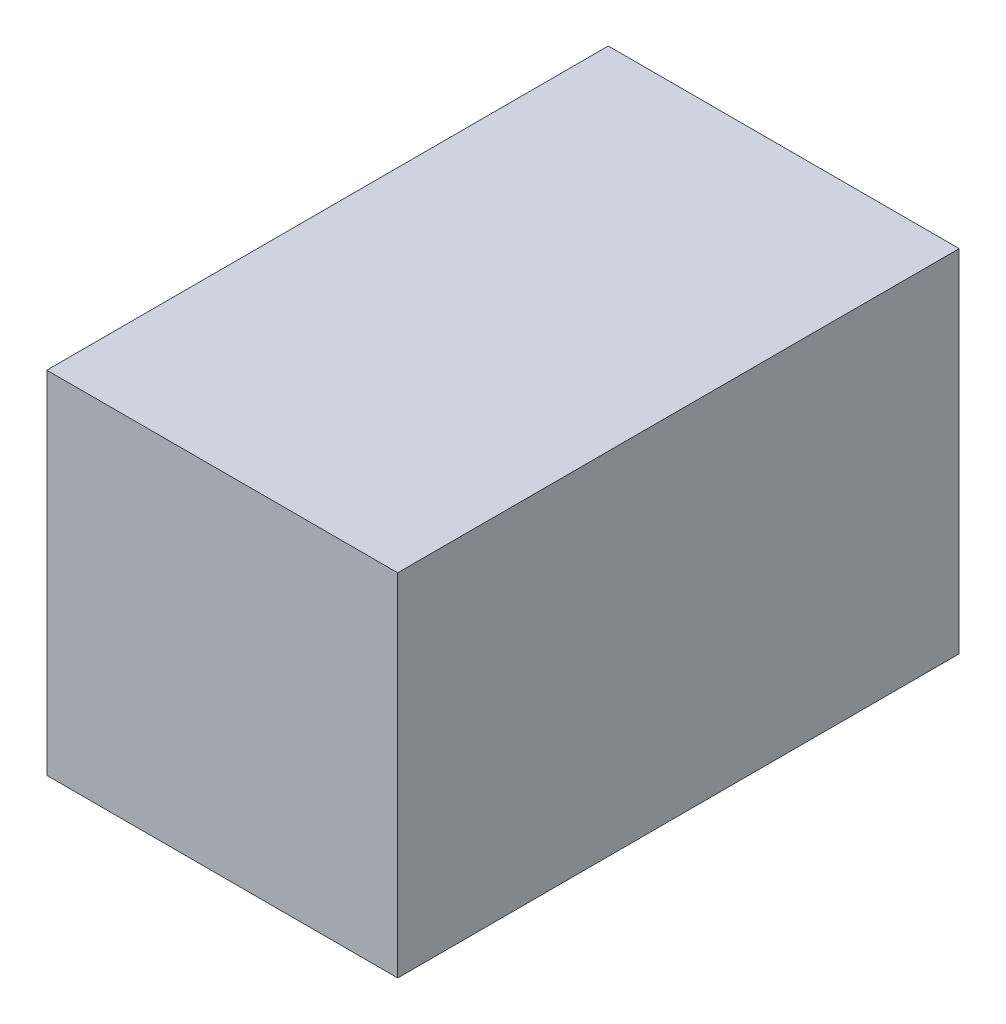
ISO-10303-21;
HEADER;
FILE_DESCRIPTION(('STEP AP214'),'2;1');
FILE_NAME('part.step','',(''),(''),'','','');
FILE_SCHEMA(('AUTOMOTIVE_DESIGN { 1 0 10303 214 1 1 1 1 }'));
ENDSEC;
DATA;
#1=APPLICATION_CONTEXT('core data for automotive mechanical design processes');
#2=APPLICATION_PROTOCOL_DEFINITION('international standard','automotive_design',2000,#1);
#3=PRODUCT_CONTEXT('',#1,'mechanical');
#4=PRODUCT('Part','Part','',(#3));
#5=PRODUCT_RELATED_PRODUCT_CATEGORY('part','',(#4));
#6=PRODUCT_DEFINITION_FORMATION('','',#4);
#7=PRODUCT_DEFINITION_CONTEXT('part definition',#1,'design');
#8=PRODUCT_DEFINITION('design','',#6,#7);
#9=PRODUCT_DEFINITION_SHAPE('','',#8);
#10=(LENGTH_UNIT() NAMED_UNIT(*) SI_UNIT(.MILLI.,.METRE.));
#11=(NAMED_UNIT(*) PLANE_ANGLE_UNIT() SI_UNIT($,.RADIAN.));
#12=(NAMED_UNIT(*) SI_UNIT($,.STERADIAN.) SOLID_ANGLE_UNIT());
#13=UNCERTAINTY_MEASURE_WITH_UNIT(LENGTH_MEASURE(1.E-05),#10,'distance_accuracy_value','');
#14=(GEOMETRIC_REPRESENTATION_CONTEXT(3) GLOBAL_UNCERTAINTY_ASSIGNED_CONTEXT((#13)) GLOBAL_UNIT_ASSIGNED_CONTEXT((#10,
#11,#12)) REPRESENTATION_CONTEXT('',''));
#15=CARTESIAN_POINT('',(0.,0.,0.));
#16=DIRECTION('',(0.,0.,1.));
#17=DIRECTION('',(1.,0.,0.));
#18=AXIS2_PLACEMENT_3D('',#15,#16,#17);
#19=CARTESIAN_POINT('',(0.5,1.,-0.800000000000001));
#20=DIRECTION('',(-1.,0.,0.));
#21=DIRECTION('',(0.,0.,1.));
#22=AXIS2_PLACEMENT_3D('',#19,#20,#21);
#23=PLANE('',#22);
#24=DIRECTION('',(0.,0.,-1.));
#25=VECTOR('',#24,1.);
#26=CARTESIAN_POINT('',(0.5,0.,-0.800000000000001));
#27=LINE('',#26,#25);
#28=CARTESIAN_POINT('',(0.5,0.,0.799999999999999));
#29=VERTEX_POINT('',#28);
#30=CARTESIAN_POINT('',(0.5,0.,-0.800000000000001));
#31=VERTEX_POINT('',#30);
#32=EDGE_CURVE('E97',#29,#31,#27,.T.);
#33=ORIENTED_EDGE('',*,*,#32,.T.);
#34=DIRECTION('',(0.,-1.,0.));
#35=VECTOR('',#34,1.);
#36=CARTESIAN_POINT('',(0.5,1.,-0.800000000000001));
#37=LINE('',#36,#35);
#38=CARTESIAN_POINT('',(0.5,1.,-0.800000000000001));
#39=VERTEX_POINT('',#38);
#40=EDGE_CURVE('E11',#39,#31,#37,.T.);
#41=ORIENTED_EDGE('',*,*,#40,.F.);
#42=DIRECTION('',(0.,0.,-1.));
#43=VECTOR('',#42,1.);
#44=CARTESIAN_POINT('',(0.5,1.,-0.800000000000001));
#45=LINE('',#44,#43);
#46=CARTESIAN_POINT('',(0.5,1.,0.799999999999999));
#47=VERTEX_POINT('',#46);
#48=EDGE_CURVE('E85',#47,#39,#45,.T.);
#49=ORIENTED_EDGE('',*,*,#48,.F.);
#50=DIRECTION('',(0.,-1.,0.));
#51=VECTOR('',#50,1.);
#52=CARTESIAN_POINT('',(0.5,1.,0.799999999999999));
#53=LINE('',#52,#51);
#54=EDGE_CURVE('E93',#47,#29,#53,.T.);
#55=ORIENTED_EDGE('',*,*,#54,.T.);
#56=EDGE_LOOP('',(#33,#41,#49,#55));
#57=FACE_BOUND('',#56,.T.);
#58=ADVANCED_FACE('F34',(#57),#23,.F.);
#59=CARTESIAN_POINT('',(-0.5,1.,-0.800000000000001));
#60=DIRECTION('',(0.,0.,1.));
#61=DIRECTION('',(1.,0.,0.));
#62=AXIS2_PLACEMENT_3D('',#59,#60,#61);
#63=PLANE('',#62);
#64=DIRECTION('',(-1.,0.,0.));
#65=VECTOR('',#64,1.);
#66=CARTESIAN_POINT('',(-0.5,0.,-0.800000000000001));
#67=LINE('',#66,#65);
#68=CARTESIAN_POINT('',(-0.5,0.,-0.800000000000001));
#69=VERTEX_POINT('',#68);
#70=EDGE_CURVE('E89',#31,#69,#67,.T.);
#71=ORIENTED_EDGE('',*,*,#70,.T.);
#72=DIRECTION('',(0.,-1.,0.));
#73=VECTOR('',#72,1.);
#74=CARTESIAN_POINT('',(-0.5,1.,-0.800000000000001));
#75=LINE('',#74,#73);
#76=CARTESIAN_POINT('',(-0.5,1.,-0.800000000000001));
#77=VERTEX_POINT('',#76);
#78=EDGE_CURVE('E42',#77,#69,#75,.T.);
#79=ORIENTED_EDGE('',*,*,#78,.F.);
#80=DIRECTION('',(-1.,0.,0.));
#81=VECTOR('',#80,1.);
#82=CARTESIAN_POINT('',(-0.5,1.,-0.800000000000001));
#83=LINE('',#82,#81);
#84=EDGE_CURVE('E80',#39,#77,#83,.T.);
#85=ORIENTED_EDGE('',*,*,#84,.F.);
#86=ORIENTED_EDGE('',*,*,#40,.T.);
#87=EDGE_LOOP('',(#71,#79,#85,#86));
#88=FACE_BOUND('',#87,.T.);
#89=ADVANCED_FACE('F88',(#88),#63,.F.);
#90=CARTESIAN_POINT('',(-0.5,1.,-0.800000000000001));
#91=DIRECTION('',(1.,0.,0.));
#92=DIRECTION('',(0.,0.,-1.));
#93=AXIS2_PLACEMENT_3D('',#90,#91,#92);
#94=PLANE('',#93);
#95=DIRECTION('',(0.,0.,1.));
#96=VECTOR('',#95,1.);
#97=CARTESIAN_POINT('',(-0.5,0.,-0.800000000000001));
#98=LINE('',#97,#96);
#99=CARTESIAN_POINT('',(-0.5,0.,0.799999999999999));
#100=VERTEX_POINT('',#99);
#101=EDGE_CURVE('E67',#69,#100,#98,.T.);
#102=ORIENTED_EDGE('',*,*,#101,.T.);
#103=DIRECTION('',(0.,-1.,0.));
#104=VECTOR('',#103,1.);
#105=CARTESIAN_POINT('',(-0.5,1.,0.799999999999999));
#106=LINE('',#105,#104);
#107=CARTESIAN_POINT('',(-0.5,1.,0.799999999999999));
#108=VERTEX_POINT('',#107);
#109=EDGE_CURVE('E90',#108,#100,#106,.T.);
#110=ORIENTED_EDGE('',*,*,#109,.F.);
#111=DIRECTION('',(0.,0.,1.));
#112=VECTOR('',#111,1.);
#113=CARTESIAN_POINT('',(-0.5,1.,-0.800000000000001));
#114=LINE('',#113,#112);
#115=EDGE_CURVE('E83',#77,#108,#114,.T.);
#116=ORIENTED_EDGE('',*,*,#115,.F.);
#117=ORIENTED_EDGE('',*,*,#78,.T.);
#118=EDGE_LOOP('',(#102,#110,#116,#117));
#119=FACE_BOUND('',#118,.T.);
#120=ADVANCED_FACE('F91',(#119),#94,.F.);
#121=CARTESIAN_POINT('',(-0.5,1.,0.799999999999999));
#122=DIRECTION('',(0.,0.,-1.));
#123=DIRECTION('',(-1.,0.,0.));
#124=AXIS2_PLACEMENT_3D('',#121,#122,#123);
#125=PLANE('',#124);
#126=DIRECTION('',(1.,0.,0.));
#127=VECTOR('',#126,1.);
#128=CARTESIAN_POINT('',(-0.5,0.,0.799999999999999));
#129=LINE('',#128,#127);
#130=EDGE_CURVE('E73',#100,#29,#129,.T.);
#131=ORIENTED_EDGE('',*,*,#130,.T.);
#132=ORIENTED_EDGE('',*,*,#54,.F.);
#133=DIRECTION('',(1.,0.,0.));
#134=VECTOR('',#133,1.);
#135=CARTESIAN_POINT('',(-0.5,1.,0.799999999999999));
#136=LINE('',#135,#134);
#137=EDGE_CURVE('E50',#108,#47,#136,.T.);
#138=ORIENTED_EDGE('',*,*,#137,.F.);
#139=ORIENTED_EDGE('',*,*,#109,.T.);
#140=EDGE_LOOP('',(#131,#132,#138,#139));
#141=FACE_BOUND('',#140,.T.);
#142=ADVANCED_FACE('F104',(#141),#125,.F.);
#143=CARTESIAN_POINT('',(0.,1.,0.));
#144=DIRECTION('',(0.,1.,0.));
#145=DIRECTION('',(0.,0.,1.));
#146=AXIS2_PLACEMENT_3D('',#143,#144,#145);
#147=PLANE('',#146);
#148=ORIENTED_EDGE('',*,*,#48,.T.);
#149=ORIENTED_EDGE('',*,*,#84,.T.);
#150=ORIENTED_EDGE('',*,*,#115,.T.);
#151=ORIENTED_EDGE('',*,*,#137,.T.);
#152=EDGE_LOOP('',(#148,#149,#150,#151));
#153=FACE_BOUND('',#152,.T.);
#154=ADVANCED_FACE('F81',(#153),#147,.T.);
#155=CARTESIAN_POINT('',(0.,0.,0.));
#156=DIRECTION('',(0.,1.,0.));
#157=DIRECTION('',(0.,0.,1.));
#158=AXIS2_PLACEMENT_3D('',#155,#156,#157);
#159=PLANE('',#158);
#160=ORIENTED_EDGE('',*,*,#32,.F.);
#161=ORIENTED_EDGE('',*,*,#130,.F.);
#162=ORIENTED_EDGE('',*,*,#101,.F.);
#163=ORIENTED_EDGE('',*,*,#70,.F.);
#164=EDGE_LOOP('',(#160,#161,#162,#163));
#165=FACE_BOUND('',#164,.T.);
#166=ADVANCED_FACE('F107',(#165),#159,.F.);
#167=CLOSED_SHELL('',(#58,#89,#120,#142,#154,#166));
#168=MANIFOLD_SOLID_BREP('B2',#167);
#169=ADVANCED_BREP_SHAPE_REPRESENTATION('',(#18,#168),#14);
#170=SHAPE_DEFINITION_REPRESENTATION(#9,#169);
ENDSEC;
END-ISO-10303-21;
